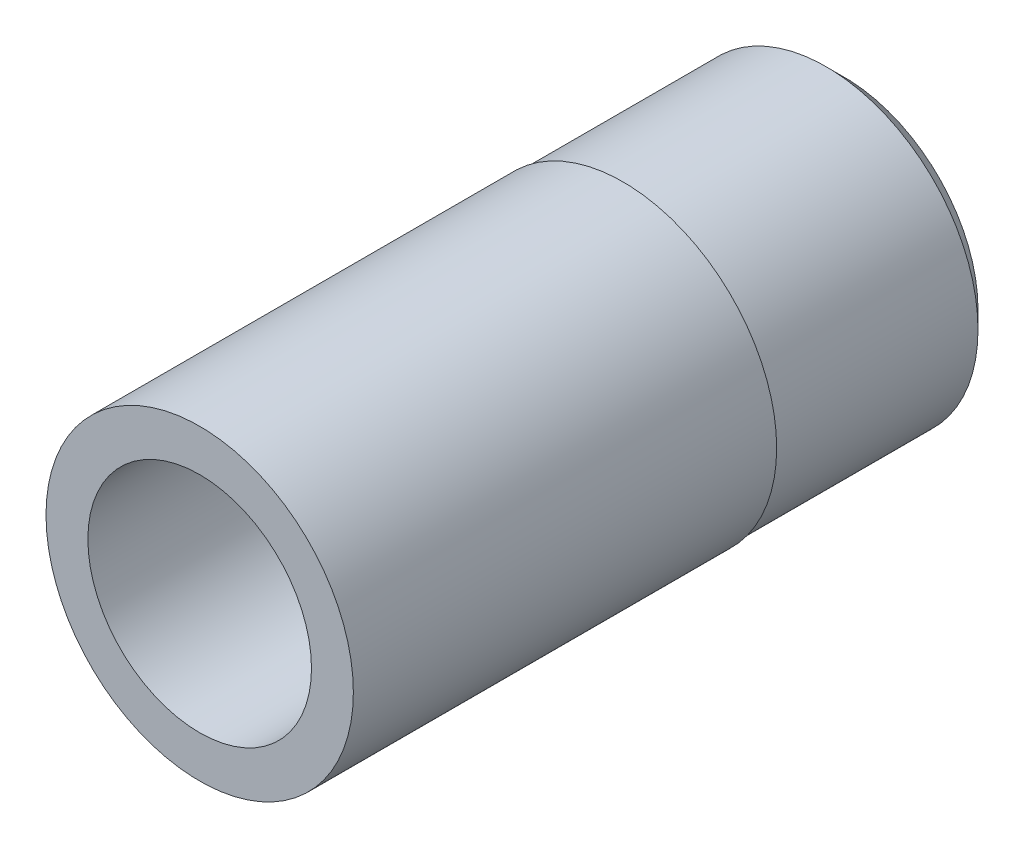
ISO-10303-21;
HEADER;
FILE_DESCRIPTION(('STEP AP214'),'2;1');
FILE_NAME('part.step','',(''),(''),'','','');
FILE_SCHEMA(('AUTOMOTIVE_DESIGN { 1 0 10303 214 1 1 1 1 }'));
ENDSEC;
DATA;
#1=APPLICATION_CONTEXT('core data for automotive mechanical design processes');
#2=APPLICATION_PROTOCOL_DEFINITION('international standard','automotive_design',2000,#1);
#3=PRODUCT_CONTEXT('',#1,'mechanical');
#4=PRODUCT('Part','Part','',(#3));
#5=PRODUCT_RELATED_PRODUCT_CATEGORY('part','',(#4));
#6=PRODUCT_DEFINITION_FORMATION('','',#4);
#7=PRODUCT_DEFINITION_CONTEXT('part definition',#1,'design');
#8=PRODUCT_DEFINITION('design','',#6,#7);
#9=PRODUCT_DEFINITION_SHAPE('','',#8);
#10=(LENGTH_UNIT() NAMED_UNIT(*) SI_UNIT(.MILLI.,.METRE.));
#11=(NAMED_UNIT(*) PLANE_ANGLE_UNIT() SI_UNIT($,.RADIAN.));
#12=(NAMED_UNIT(*) SI_UNIT($,.STERADIAN.) SOLID_ANGLE_UNIT());
#13=UNCERTAINTY_MEASURE_WITH_UNIT(LENGTH_MEASURE(1.E-05),#10,'distance_accuracy_value','');
#14=(GEOMETRIC_REPRESENTATION_CONTEXT(3) GLOBAL_UNCERTAINTY_ASSIGNED_CONTEXT((#13)) GLOBAL_UNIT_ASSIGNED_CONTEXT((#10,
#11,#12)) REPRESENTATION_CONTEXT('',''));
#15=CARTESIAN_POINT('',(0.,0.,0.));
#16=DIRECTION('',(0.,0.,1.));
#17=DIRECTION('',(1.,0.,0.));
#18=AXIS2_PLACEMENT_3D('',#15,#16,#17);
#19=CARTESIAN_POINT('',(0.,0.,0.));
#20=DIRECTION('',(0.,0.,1.));
#21=DIRECTION('',(1.,0.,0.));
#22=AXIS2_PLACEMENT_3D('',#19,#20,#21);
#23=PLANE('',#22);
#24=CARTESIAN_POINT('',(0.,0.,0.));
#25=DIRECTION('',(0.,0.,1.));
#26=DIRECTION('',(1.,0.,0.));
#27=AXIS2_PLACEMENT_3D('',#24,#25,#26);
#28=CIRCLE('',#27,12.15);
#29=CARTESIAN_POINT('',(12.15,0.,0.));
#30=VERTEX_POINT('',#29);
#31=EDGE_CURVE('E50',#30,#30,#28,.T.);
#32=ORIENTED_EDGE('',*,*,#31,.T.);
#33=EDGE_LOOP('',(#32));
#34=FACE_BOUND('',#33,.T.);
#35=CARTESIAN_POINT('',(0.,0.,0.));
#36=DIRECTION('',(0.,0.,1.));
#37=DIRECTION('',(1.,0.,0.));
#38=AXIS2_PLACEMENT_3D('',#35,#36,#37);
#39=CIRCLE('',#38,14.579);
#40=CARTESIAN_POINT('',(14.579,0.,0.));
#41=VERTEX_POINT('',#40);
#42=EDGE_CURVE('E62',#41,#41,#39,.T.);
#43=ORIENTED_EDGE('',*,*,#42,.F.);
#44=EDGE_LOOP('',(#43));
#45=FACE_BOUND('',#44,.T.);
#46=ADVANCED_FACE('F39',(#34,#45),#23,.F.);
#47=CARTESIAN_POINT('',(0.,0.,70.));
#48=DIRECTION('',(0.,0.,1.));
#49=DIRECTION('',(1.,0.,0.));
#50=AXIS2_PLACEMENT_3D('',#47,#48,#49);
#51=PLANE('',#50);
#52=CARTESIAN_POINT('',(0.,0.,70.));
#53=DIRECTION('',(0.,0.,1.));
#54=DIRECTION('',(1.,0.,0.));
#55=AXIS2_PLACEMENT_3D('',#52,#53,#54);
#56=CIRCLE('',#55,16.7);
#57=CARTESIAN_POINT('',(16.7,0.,70.));
#58=VERTEX_POINT('',#57);
#59=EDGE_CURVE('E10',#58,#58,#56,.T.);
#60=ORIENTED_EDGE('',*,*,#59,.T.);
#61=EDGE_LOOP('',(#60));
#62=FACE_BOUND('',#61,.T.);
#63=CARTESIAN_POINT('',(0.,0.,70.));
#64=DIRECTION('',(0.,0.,1.));
#65=DIRECTION('',(1.,0.,0.));
#66=AXIS2_PLACEMENT_3D('',#63,#64,#65);
#67=CIRCLE('',#66,12.15);
#68=CARTESIAN_POINT('',(12.15,0.,70.));
#69=VERTEX_POINT('',#68);
#70=EDGE_CURVE('E46',#69,#69,#67,.T.);
#71=ORIENTED_EDGE('',*,*,#70,.F.);
#72=EDGE_LOOP('',(#71));
#73=FACE_BOUND('',#72,.T.);
#74=ADVANCED_FACE('F79',(#62,#73),#51,.T.);
#75=CARTESIAN_POINT('',(0.,0.,70.));
#76=DIRECTION('',(0.,0.,-1.));
#77=DIRECTION('',(-1.,0.,0.));
#78=AXIS2_PLACEMENT_3D('',#75,#76,#77);
#79=CYLINDRICAL_SURFACE('',#78,16.7);
#80=CARTESIAN_POINT('',(0.,0.,24.));
#81=DIRECTION('',(0.,0.,1.));
#82=DIRECTION('',(1.,0.,0.));
#83=AXIS2_PLACEMENT_3D('',#80,#81,#82);
#84=CIRCLE('',#83,16.7);
#85=CARTESIAN_POINT('',(16.7,0.,24.));
#86=VERTEX_POINT('',#85);
#87=EDGE_CURVE('E59',#86,#86,#84,.T.);
#88=ORIENTED_EDGE('',*,*,#87,.T.);
#89=EDGE_LOOP('',(#88));
#90=FACE_BOUND('',#89,.T.);
#91=ORIENTED_EDGE('',*,*,#59,.F.);
#92=EDGE_LOOP('',(#91));
#93=FACE_BOUND('',#92,.T.);
#94=ADVANCED_FACE('F41',(#90,#93),#79,.T.);
#95=CARTESIAN_POINT('',(0.,0.,70.));
#96=DIRECTION('',(0.,0.,-1.));
#97=DIRECTION('',(-1.,0.,0.));
#98=AXIS2_PLACEMENT_3D('',#95,#96,#97);
#99=CYLINDRICAL_SURFACE('',#98,12.15);
#100=ORIENTED_EDGE('',*,*,#70,.T.);
#101=EDGE_LOOP('',(#100));
#102=FACE_BOUND('',#101,.T.);
#103=ORIENTED_EDGE('',*,*,#31,.F.);
#104=EDGE_LOOP('',(#103));
#105=FACE_BOUND('',#104,.T.);
#106=ADVANCED_FACE('F86',(#102,#105),#99,.F.);
#107=CARTESIAN_POINT('',(0.,0.,0.));
#108=DIRECTION('',(0.,0.,1.));
#109=DIRECTION('',(1.,0.,0.));
#110=AXIS2_PLACEMENT_3D('',#107,#108,#109);
#111=CYLINDRICAL_SURFACE('',#110,16.5);
#112=CARTESIAN_POINT('',(0.,0.,24.));
#113=DIRECTION('',(0.,0.,1.));
#114=DIRECTION('',(1.,0.,0.));
#115=AXIS2_PLACEMENT_3D('',#112,#113,#114);
#116=CIRCLE('',#115,16.5);
#117=CARTESIAN_POINT('',(16.5,0.,24.));
#118=VERTEX_POINT('',#117);
#119=EDGE_CURVE('E55',#118,#118,#116,.T.);
#120=ORIENTED_EDGE('',*,*,#119,.F.);
#121=EDGE_LOOP('',(#120));
#122=FACE_BOUND('',#121,.T.);
#123=CARTESIAN_POINT('',(0.,0.,1.92099999999999));
#124=DIRECTION('',(0.,0.,1.));
#125=DIRECTION('',(1.,0.,0.));
#126=AXIS2_PLACEMENT_3D('',#123,#124,#125);
#127=CIRCLE('',#126,16.5);
#128=CARTESIAN_POINT('',(16.5,0.,1.92099999999999));
#129=VERTEX_POINT('',#128);
#130=EDGE_CURVE('E65',#129,#129,#127,.T.);
#131=ORIENTED_EDGE('',*,*,#130,.T.);
#132=EDGE_LOOP('',(#131));
#133=FACE_BOUND('',#132,.T.);
#134=ADVANCED_FACE('F69',(#122,#133),#111,.T.);
#135=CARTESIAN_POINT('',(16.5,0.,24.));
#136=DIRECTION('',(0.,0.,1.));
#137=DIRECTION('',(1.,0.,0.));
#138=AXIS2_PLACEMENT_3D('',#135,#136,#137);
#139=PLANE('',#138);
#140=ORIENTED_EDGE('',*,*,#87,.F.);
#141=EDGE_LOOP('',(#140));
#142=FACE_BOUND('',#141,.T.);
#143=ORIENTED_EDGE('',*,*,#119,.T.);
#144=EDGE_LOOP('',(#143));
#145=FACE_BOUND('',#144,.T.);
#146=ADVANCED_FACE('F74',(#142,#145),#139,.F.);
#147=CARTESIAN_POINT('',(0.,0.,0.));
#148=DIRECTION('',(0.,0.,1.));
#149=DIRECTION('',(1.,0.,0.));
#150=AXIS2_PLACEMENT_3D('',#147,#148,#149);
#151=CONICAL_SURFACE('',#150,14.579,0.785398163397448);
#152=ORIENTED_EDGE('',*,*,#130,.F.);
#153=EDGE_LOOP('',(#152));
#154=FACE_BOUND('',#153,.T.);
#155=ORIENTED_EDGE('',*,*,#42,.T.);
#156=EDGE_LOOP('',(#155));
#157=FACE_BOUND('',#156,.T.);
#158=ADVANCED_FACE('F71',(#154,#157),#151,.T.);
#159=CLOSED_SHELL('',(#46,#74,#94,#106,#134,#146,#158));
#160=MANIFOLD_SOLID_BREP('B2',#159);
#161=ADVANCED_BREP_SHAPE_REPRESENTATION('',(#18,#160),#14);
#162=SHAPE_DEFINITION_REPRESENTATION(#9,#161);
ENDSEC;
END-ISO-10303-21;
